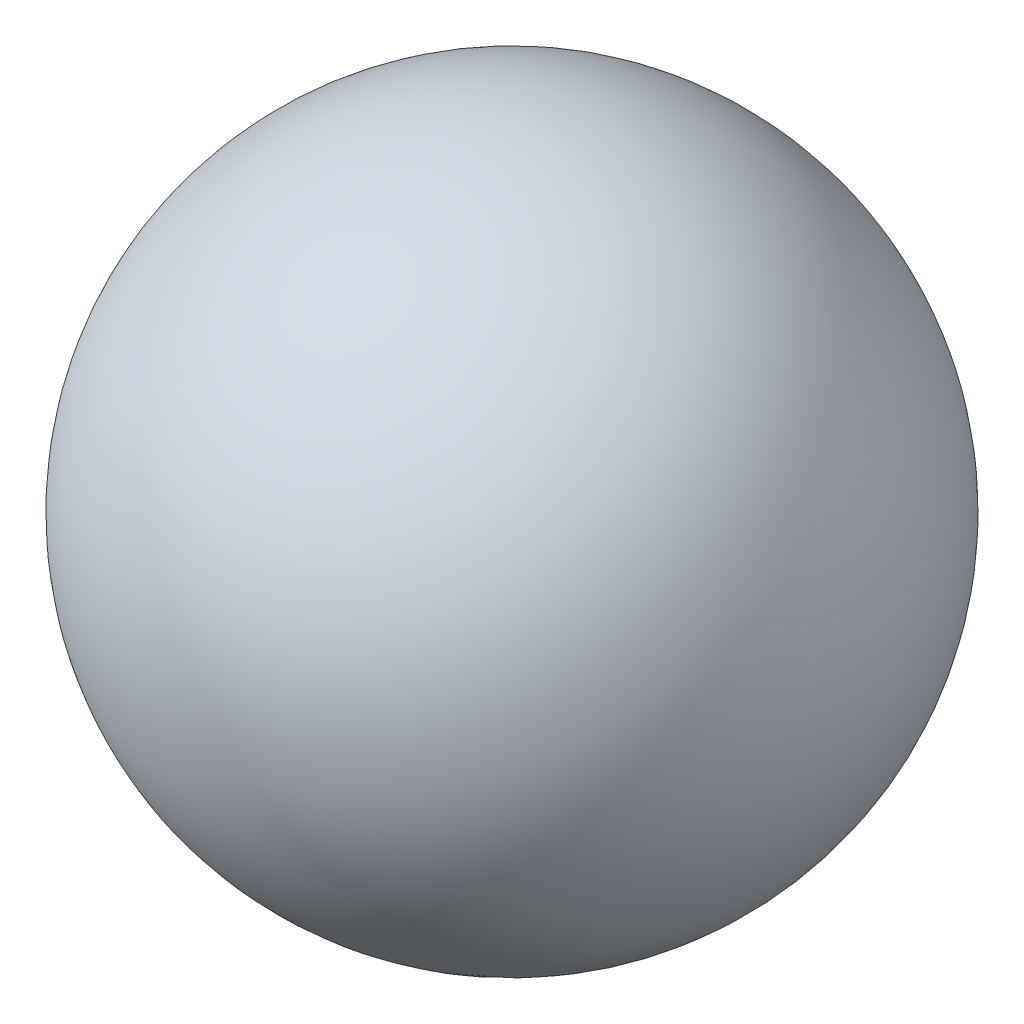
ISO-10303-21;
HEADER;
FILE_DESCRIPTION(('STEP AP214'),'2;1');
FILE_NAME('part.step','',(''),(''),'','','');
FILE_SCHEMA(('AUTOMOTIVE_DESIGN { 1 0 10303 214 1 1 1 1 }'));
ENDSEC;
DATA;
#1=APPLICATION_CONTEXT('core data for automotive mechanical design processes');
#2=APPLICATION_PROTOCOL_DEFINITION('international standard','automotive_design',2000,#1);
#3=PRODUCT_CONTEXT('',#1,'mechanical');
#4=PRODUCT('Part','Part','',(#3));
#5=PRODUCT_RELATED_PRODUCT_CATEGORY('part','',(#4));
#6=PRODUCT_DEFINITION_FORMATION('','',#4);
#7=PRODUCT_DEFINITION_CONTEXT('part definition',#1,'design');
#8=PRODUCT_DEFINITION('design','',#6,#7);
#9=PRODUCT_DEFINITION_SHAPE('','',#8);
#10=(LENGTH_UNIT() NAMED_UNIT(*) SI_UNIT(.MILLI.,.METRE.));
#11=(NAMED_UNIT(*) PLANE_ANGLE_UNIT() SI_UNIT($,.RADIAN.));
#12=(NAMED_UNIT(*) SI_UNIT($,.STERADIAN.) SOLID_ANGLE_UNIT());
#13=UNCERTAINTY_MEASURE_WITH_UNIT(LENGTH_MEASURE(1.E-05),#10,'distance_accuracy_value','');
#14=(GEOMETRIC_REPRESENTATION_CONTEXT(3) GLOBAL_UNCERTAINTY_ASSIGNED_CONTEXT((#13)) GLOBAL_UNIT_ASSIGNED_CONTEXT((#10,
#11,#12)) REPRESENTATION_CONTEXT('',''));
#15=CARTESIAN_POINT('',(0.,0.,0.));
#16=DIRECTION('',(0.,0.,1.));
#17=DIRECTION('',(1.,0.,0.));
#18=AXIS2_PLACEMENT_3D('',#15,#16,#17);
#19=CARTESIAN_POINT('',(0.,0.,0.));
#20=DIRECTION('',(0.,0.,1.));
#21=DIRECTION('',(-1.,0.,0.));
#22=AXIS2_PLACEMENT_3D('',#19,#20,#21);
#23=SPHERICAL_SURFACE('',#22,20.);
#24=CARTESIAN_POINT('',(-6.5,0.,0.));
#25=DIRECTION('',(-1.,0.,0.));
#26=DIRECTION('',(0.,0.,1.));
#27=AXIS2_PLACEMENT_3D('',#24,#25,#26);
#28=CIRCLE('',#27,18.9142803193777);
#29=CARTESIAN_POINT('',(-6.5,-16.8967452487158,-8.5));
#30=VERTEX_POINT('',#29);
#31=CARTESIAN_POINT('',(-6.5,-16.8967452487158,8.5));
#32=VERTEX_POINT('',#31);
#33=EDGE_CURVE('E134',#30,#32,#28,.T.);
#34=ORIENTED_EDGE('',*,*,#33,.T.);
#35=CARTESIAN_POINT('',(-6.5,-16.8967452487158,8.5));
#36=CARTESIAN_POINT('',(-6.49999376318244,-16.8367881342585,8.61919141730628));
#37=CARTESIAN_POINT('',(-6.49467104533204,-16.7772219118733,8.73852686841631));
#38=CARTESIAN_POINT('',(-6.47327854145581,-16.6592450993487,8.97686071788792));
#39=CARTESIAN_POINT('',(-6.45720456710805,-16.6008349687168,9.09585896673711));
#40=CARTESIAN_POINT('',(-6.3925007431121,-16.4274610357574,9.45231560061206));
#41=CARTESIAN_POINT('',(-6.32738664378277,-16.314890403822,9.68817108218945));
#42=CARTESIAN_POINT('',(-6.15262165026794,-16.1001752719661,10.1489887531046));
#43=CARTESIAN_POINT('',(-6.04284925214079,-15.998060175278,10.373919334601));
#44=CARTESIAN_POINT('',(-5.84561038890766,-15.8568845783667,10.6960824044829));
#45=CARTESIAN_POINT('',(-5.77445963035965,-15.8118369791686,10.8009028563226));
#46=CARTESIAN_POINT('',(-5.62151864141891,-15.7263629975264,11.004454776878));
#47=CARTESIAN_POINT('',(-5.53973510966124,-15.6859337354104,11.1031900220199));
#48=CARTESIAN_POINT('',(-5.37423953151036,-15.6139957920711,11.28430049176));
#49=CARTESIAN_POINT('',(-5.29145989423178,-15.5820037606912,11.3673372721214));
#50=CARTESIAN_POINT('',(-5.11800479405772,-15.5228802142727,11.5265317286208));
#51=CARTESIAN_POINT('',(-5.02733403862039,-15.495745830536,11.6026934515803));
#52=CARTESIAN_POINT('',(-4.83870098175006,-15.4468103505463,11.7472438065387));
#53=CARTESIAN_POINT('',(-4.74074148755169,-15.4250072147064,11.8156354057927));
#54=CARTESIAN_POINT('',(-4.53829135479281,-15.3871509666637,11.9437934115337));
#55=CARTESIAN_POINT('',(-4.43380185354477,-15.3710968564296,12.0035613140184));
#56=CARTESIAN_POINT('',(-4.23365775172472,-15.3468202002661,12.106291007457));
#57=CARTESIAN_POINT('',(-4.13869811103613,-15.3378360100475,12.150431731578));
#58=CARTESIAN_POINT('',(-3.94532985325401,-15.3245772396421,12.2312192704823));
#59=CARTESIAN_POINT('',(-3.84692162959918,-15.320302124004,12.2678669368872));
#60=CARTESIAN_POINT('',(-3.64751450761934,-15.3165360276597,12.3333032600585));
#61=CARTESIAN_POINT('',(-3.54651748819676,-15.3170416700219,12.3620974494102));
#62=CARTESIAN_POINT('',(-3.3427374099056,-15.3228177568241,12.4116221190603));
#63=CARTESIAN_POINT('',(-3.23995498732285,-15.3280865366015,12.4323554129305));
#64=CARTESIAN_POINT('',(-3.03088558050845,-15.3434876216961,12.4660602696253));
#65=CARTESIAN_POINT('',(-2.92457449976527,-15.3537361309077,12.4788288243646));
#66=CARTESIAN_POINT('',(-2.71204841485452,-15.3789236562842,12.4958003911938));
#67=CARTESIAN_POINT('',(-2.60583367151853,-15.3938528619271,12.5000211822262));
#68=CARTESIAN_POINT('',(-2.5,-15.4110350074224,12.5));
#69=B_SPLINE_CURVE_WITH_KNOTS('',3,(#35,#36,#37,#38,#39,#40,#41,#42,#43,#44,#45,#46,#47,#48,#49,
#50,#51,#52,#53,#54,#55,#56,#57,#58,#59,#60,#61,#62,#63,#64,#65,#66,#67,#68),.UNSPECIFIED.,.F.,
.F.,(4,2,2,2,2,2,2,2,2,2,2,2,2,2,2,2,4),(0.,0.400059142691313,0.800274225587917,
1.60423831208424,2.41040456820755,2.8132520749623,3.21584700703939,3.57994025204138,
3.94381776627734,4.30755585254038,4.67123076319907,4.98612350570043,5.30098043922891,
5.61561498734561,5.93013961674454,6.25238444943157,6.57395833692662),.UNSPECIFIED.);
#70=CARTESIAN_POINT('',(-2.5,-15.4110350074224,12.5));
#71=VERTEX_POINT('',#70);
#72=EDGE_CURVE('E162',#32,#71,#69,.T.);
#73=ORIENTED_EDGE('',*,*,#72,.T.);
#74=CARTESIAN_POINT('',(0.,0.,12.5));
#75=DIRECTION('',(0.,0.,1.));
#76=DIRECTION('',(1.,0.,0.));
#77=AXIS2_PLACEMENT_3D('',#74,#75,#76);
#78=CIRCLE('',#77,15.612494995996);
#79=CARTESIAN_POINT('',(2.5,-15.4110350074224,12.5));
#80=VERTEX_POINT('',#79);
#81=EDGE_CURVE('E125',#71,#80,#78,.T.);
#82=ORIENTED_EDGE('',*,*,#81,.T.);
#83=CARTESIAN_POINT('',(2.5,-15.4110350074224,12.5));
#84=CARTESIAN_POINT('',(2.59738038519083,-15.3952282696164,12.5000148213943));
#85=CARTESIAN_POINT('',(2.69508024486914,-15.3813255532214,12.4964443244474));
#86=CARTESIAN_POINT('',(2.89044586607563,-15.3574814182854,12.4820993500437));
#87=CARTESIAN_POINT('',(2.98811162156256,-15.3475405121033,12.4713239412978));
#88=CARTESIAN_POINT('',(3.18255066929817,-15.3317903628193,12.4425594165742));
#89=CARTESIAN_POINT('',(3.27932516375751,-15.325974361548,12.4245821759372));
#90=CARTESIAN_POINT('',(3.47142933766073,-15.318532360721,12.3814961401043));
#91=CARTESIAN_POINT('',(3.56675913489966,-15.3169060177094,12.3563879296716));
#92=CARTESIAN_POINT('',(3.75539293433253,-15.3178685885579,12.2991727800464));
#93=CARTESIAN_POINT('',(3.84869448864158,-15.3204623373541,12.2670578498045));
#94=CARTESIAN_POINT('',(4.03251988927804,-15.3298356353688,12.1960918680488));
#95=CARTESIAN_POINT('',(4.12304268359437,-15.3366167498573,12.1572383014875));
#96=CARTESIAN_POINT('',(4.30060029606627,-15.3542614783381,12.07316063338));
#97=CARTESIAN_POINT('',(4.38763726831352,-15.3651225266426,12.0279405466037));
#98=CARTESIAN_POINT('',(4.55773919754725,-15.3907677735966,11.9315137822873));
#99=CARTESIAN_POINT('',(4.64080262813068,-15.4055534658075,11.8803048297852));
#100=CARTESIAN_POINT('',(4.88337806728256,-15.45553866524,11.718267896581));
#101=CARTESIAN_POINT('',(5.03626357260689,-15.4963651054398,11.5990354006361));
#102=CARTESIAN_POINT('',(5.32106637967054,-15.5909729245315,11.342262090132));
#103=CARTESIAN_POINT('',(5.45297406407673,-15.6447602170995,11.204712931043));
#104=CARTESIAN_POINT('',(5.70421893362637,-15.7680434301898,10.9030476449279));
#105=CARTESIAN_POINT('',(5.82158158675651,-15.8384770121789,10.7376716659214));
#106=CARTESIAN_POINT('',(6.0285963358221,-15.9892385784958,10.3945266003605));
#107=CARTESIAN_POINT('',(6.1182285174705,-16.0695736158011,10.216748719296));
#108=CARTESIAN_POINT('',(6.27889155103766,-16.2481674906663,9.83009006167));
#109=CARTESIAN_POINT('',(6.34617113011318,-16.3474101903572,9.62010759001408));
#110=CARTESIAN_POINT('',(6.44516668446247,-16.5519643767159,9.1951210889375));
#111=CARTESIAN_POINT('',(6.47692305807516,-16.6572688260762,8.9801230481741));
#112=CARTESIAN_POINT('',(6.49708269575086,-16.8081535716689,8.67662013097272));
#113=CARTESIAN_POINT('',(6.50000578257493,-16.8523596129254,8.5882364623455));
#114=CARTESIAN_POINT('',(6.50000000000009,-16.8967452487158,8.49999999999999));
#115=B_SPLINE_CURVE_WITH_KNOTS('',3,(#83,#84,#85,#86,#87,#88,#89,#90,#91,#92,#93,#94,#95,#96,
#97,#98,#99,#100,#101,#102,#103,#104,#105,#106,#107,#108,#109,#110,#111,#112,#113,#114),
.UNSPECIFIED.,.F.,.F.,(4,2,2,2,2,2,2,2,2,2,2,2,2,2,2,4),(0.,0.295896456010633,0.591831166267823,
0.887279895354373,1.18270440365701,1.47846761661165,1.77434145515047,2.07002954249381,
2.36583031854621,2.9574702952876,3.54938073373924,4.19080463658617,4.83268810636278,
5.55520721793995,6.27690381531875,6.57330293254065),.UNSPECIFIED.);
#116=CARTESIAN_POINT('',(6.5,-16.8967452487158,8.5));
#117=VERTEX_POINT('',#116);
#118=EDGE_CURVE('E169',#80,#117,#115,.T.);
#119=ORIENTED_EDGE('',*,*,#118,.T.);
#120=CARTESIAN_POINT('',(6.5,0.,0.));
#121=DIRECTION('',(1.,0.,0.));
#122=DIRECTION('',(0.,0.,-1.));
#123=AXIS2_PLACEMENT_3D('',#120,#121,#122);
#124=CIRCLE('',#123,18.9142803193777);
#125=CARTESIAN_POINT('',(6.5,-16.8967452487158,-8.5));
#126=VERTEX_POINT('',#125);
#127=EDGE_CURVE('E143',#117,#126,#124,.T.);
#128=ORIENTED_EDGE('',*,*,#127,.T.);
#129=CARTESIAN_POINT('',(6.5,-16.8967452487158,-8.5));
#130=CARTESIAN_POINT('',(6.49999376318244,-16.8367881342585,-8.61919141730628));
#131=CARTESIAN_POINT('',(6.49467104533204,-16.7772219118733,-8.73852686841631));
#132=CARTESIAN_POINT('',(6.47327854145581,-16.6592450993487,-8.97686071788792));
#133=CARTESIAN_POINT('',(6.45720456710805,-16.6008349687168,-9.09585896673711));
#134=CARTESIAN_POINT('',(6.3925007431121,-16.4274610357574,-9.45231560061206));
#135=CARTESIAN_POINT('',(6.32738664378277,-16.314890403822,-9.68817108218945));
#136=CARTESIAN_POINT('',(6.15262165026794,-16.1001752719661,-10.1489887531046));
#137=CARTESIAN_POINT('',(6.04284925214079,-15.998060175278,-10.373919334601));
#138=CARTESIAN_POINT('',(5.84561038890766,-15.8568845783667,-10.6960824044829));
#139=CARTESIAN_POINT('',(5.77445963035965,-15.8118369791686,-10.8009028563226));
#140=CARTESIAN_POINT('',(5.62151864141891,-15.7263629975264,-11.004454776878));
#141=CARTESIAN_POINT('',(5.53973510966124,-15.6859337354104,-11.1031900220199));
#142=CARTESIAN_POINT('',(5.37423953151036,-15.6139957920711,-11.28430049176));
#143=CARTESIAN_POINT('',(5.29145989423178,-15.5820037606912,-11.3673372721214));
#144=CARTESIAN_POINT('',(5.11800479405772,-15.5228802142727,-11.5265317286208));
#145=CARTESIAN_POINT('',(5.02733403862039,-15.495745830536,-11.6026934515803));
#146=CARTESIAN_POINT('',(4.83870098175006,-15.4468103505463,-11.7472438065387));
#147=CARTESIAN_POINT('',(4.74074148755169,-15.4250072147064,-11.8156354057927));
#148=CARTESIAN_POINT('',(4.53829135479281,-15.3871509666637,-11.9437934115337));
#149=CARTESIAN_POINT('',(4.43380185354477,-15.3710968564296,-12.0035613140184));
#150=CARTESIAN_POINT('',(4.23365775172472,-15.3468202002661,-12.106291007457));
#151=CARTESIAN_POINT('',(4.13869811103613,-15.3378360100475,-12.150431731578));
#152=CARTESIAN_POINT('',(3.94532985325401,-15.3245772396421,-12.2312192704823));
#153=CARTESIAN_POINT('',(3.84692162959918,-15.320302124004,-12.2678669368872));
#154=CARTESIAN_POINT('',(3.64751450761934,-15.3165360276597,-12.3333032600585));
#155=CARTESIAN_POINT('',(3.54651748819676,-15.3170416700219,-12.3620974494102));
#156=CARTESIAN_POINT('',(3.3427374099056,-15.3228177568241,-12.4116221190603));
#157=CARTESIAN_POINT('',(3.23995498732285,-15.3280865366015,-12.4323554129305));
#158=CARTESIAN_POINT('',(3.03088558050845,-15.3434876216961,-12.4660602696253));
#159=CARTESIAN_POINT('',(2.92457449976527,-15.3537361309077,-12.4788288243646));
#160=CARTESIAN_POINT('',(2.71204841485452,-15.3789236562842,-12.4958003911938));
#161=CARTESIAN_POINT('',(2.60583367151853,-15.3938528619271,-12.5000211822262));
#162=CARTESIAN_POINT('',(2.5,-15.4110350074224,-12.5));
#163=B_SPLINE_CURVE_WITH_KNOTS('',3,(#129,#130,#131,#132,#133,#134,#135,#136,#137,#138,#139,
#140,#141,#142,#143,#144,#145,#146,#147,#148,#149,#150,#151,#152,#153,#154,#155,#156,#157,#158,
#159,#160,#161,#162),.UNSPECIFIED.,.F.,.F.,(4,2,2,2,2,2,2,2,2,2,2,2,2,2,2,2,4),(0.,
0.400059142691313,0.800274225587917,1.60423831208424,2.41040456820755,2.8132520749623,
3.21584700703939,3.57994025204138,3.94381776627734,4.30755585254038,4.67123076319907,
4.98612350570043,5.30098043922891,5.61561498734561,5.93013961674454,6.25238444943157,
6.57395833692662),.UNSPECIFIED.);
#164=CARTESIAN_POINT('',(2.5,-15.4110350074224,-12.5));
#165=VERTEX_POINT('',#164);
#166=EDGE_CURVE('E48',#126,#165,#163,.T.);
#167=ORIENTED_EDGE('',*,*,#166,.T.);
#168=CARTESIAN_POINT('',(0.,0.,-12.5));
#169=DIRECTION('',(0.,0.,-1.));
#170=DIRECTION('',(-1.,0.,0.));
#171=AXIS2_PLACEMENT_3D('',#168,#169,#170);
#172=CIRCLE('',#171,15.612494995996);
#173=CARTESIAN_POINT('',(-2.5,-15.4110350074224,-12.5));
#174=VERTEX_POINT('',#173);
#175=EDGE_CURVE('E131',#165,#174,#172,.T.);
#176=ORIENTED_EDGE('',*,*,#175,.T.);
#177=CARTESIAN_POINT('',(-2.5,-15.4110350074224,-12.5));
#178=CARTESIAN_POINT('',(-2.59738038519083,-15.3952282696164,-12.5000148213943));
#179=CARTESIAN_POINT('',(-2.69508024486914,-15.3813255532214,-12.4964443244474));
#180=CARTESIAN_POINT('',(-2.89044586607563,-15.3574814182854,-12.4820993500437));
#181=CARTESIAN_POINT('',(-2.98811162156256,-15.3475405121033,-12.4713239412978));
#182=CARTESIAN_POINT('',(-3.18255066929817,-15.3317903628193,-12.4425594165742));
#183=CARTESIAN_POINT('',(-3.27932516375751,-15.325974361548,-12.4245821759372));
#184=CARTESIAN_POINT('',(-3.47142933766073,-15.318532360721,-12.3814961401043));
#185=CARTESIAN_POINT('',(-3.56675913489966,-15.3169060177094,-12.3563879296716));
#186=CARTESIAN_POINT('',(-3.75539293433253,-15.3178685885579,-12.2991727800464));
#187=CARTESIAN_POINT('',(-3.84869448864158,-15.3204623373541,-12.2670578498045));
#188=CARTESIAN_POINT('',(-4.03251988927804,-15.3298356353688,-12.1960918680488));
#189=CARTESIAN_POINT('',(-4.12304268359437,-15.3366167498573,-12.1572383014875));
#190=CARTESIAN_POINT('',(-4.30060029606627,-15.3542614783381,-12.07316063338));
#191=CARTESIAN_POINT('',(-4.38763726831352,-15.3651225266426,-12.0279405466037));
#192=CARTESIAN_POINT('',(-4.55773919754725,-15.3907677735966,-11.9315137822873));
#193=CARTESIAN_POINT('',(-4.64080262813068,-15.4055534658075,-11.8803048297852));
#194=CARTESIAN_POINT('',(-4.88337806728256,-15.45553866524,-11.718267896581));
#195=CARTESIAN_POINT('',(-5.03626357260689,-15.4963651054398,-11.5990354006361));
#196=CARTESIAN_POINT('',(-5.32106637967054,-15.5909729245315,-11.342262090132));
#197=CARTESIAN_POINT('',(-5.45297406407673,-15.6447602170995,-11.204712931043));
#198=CARTESIAN_POINT('',(-5.70421893362637,-15.7680434301898,-10.9030476449279));
#199=CARTESIAN_POINT('',(-5.82158158675651,-15.8384770121789,-10.7376716659214));
#200=CARTESIAN_POINT('',(-6.0285963358221,-15.9892385784958,-10.3945266003605));
#201=CARTESIAN_POINT('',(-6.1182285174705,-16.0695736158011,-10.216748719296));
#202=CARTESIAN_POINT('',(-6.27889155103766,-16.2481674906663,-9.83009006167));
#203=CARTESIAN_POINT('',(-6.34617113011318,-16.3474101903572,-9.62010759001408));
#204=CARTESIAN_POINT('',(-6.44516668446247,-16.5519643767159,-9.1951210889375));
#205=CARTESIAN_POINT('',(-6.47692305807516,-16.6572688260762,-8.9801230481741));
#206=CARTESIAN_POINT('',(-6.49708269575086,-16.8081535716689,-8.67662013097272));
#207=CARTESIAN_POINT('',(-6.50000578257493,-16.8523596129254,-8.5882364623455));
#208=CARTESIAN_POINT('',(-6.50000000000009,-16.8967452487158,-8.49999999999999));
#209=B_SPLINE_CURVE_WITH_KNOTS('',3,(#177,#178,#179,#180,#181,#182,#183,#184,#185,#186,#187,
#188,#189,#190,#191,#192,#193,#194,#195,#196,#197,#198,#199,#200,#201,#202,#203,#204,#205,#206,
#207,#208),.UNSPECIFIED.,.F.,.F.,(4,2,2,2,2,2,2,2,2,2,2,2,2,2,2,4),(0.,0.295896456010633,
0.591831166267823,0.887279895354373,1.18270440365701,1.47846761661165,1.77434145515047,
2.07002954249381,2.36583031854621,2.9574702952876,3.54938073373924,4.19080463658617,
4.83268810636278,5.55520721793995,6.27690381531875,6.57330293254065),.UNSPECIFIED.);
#210=EDGE_CURVE('E11',#174,#30,#209,.T.);
#211=ORIENTED_EDGE('',*,*,#210,.T.);
#212=EDGE_LOOP('',(#34,#73,#82,#119,#128,#167,#176,#211));
#213=FACE_BOUND('',#212,.T.);
#214=ADVANCED_FACE('F34',(#213),#23,.T.);
#215=CARTESIAN_POINT('',(6.5,-27.,12.5));
#216=DIRECTION('',(1.,0.,0.));
#217=DIRECTION('',(0.,0.,-1.));
#218=AXIS2_PLACEMENT_3D('',#215,#216,#217);
#219=PLANE('',#218);
#220=ORIENTED_EDGE('',*,*,#127,.F.);
#221=DIRECTION('',(0.,1.,0.));
#222=VECTOR('',#221,1.);
#223=CARTESIAN_POINT('',(6.5,0.,8.5));
#224=LINE('',#223,#222);
#225=CARTESIAN_POINT('',(6.5,0.,8.5));
#226=VERTEX_POINT('',#225);
#227=EDGE_CURVE('E155',#117,#226,#224,.T.);
#228=ORIENTED_EDGE('',*,*,#227,.T.);
#229=DIRECTION('',(0.,0.,-1.));
#230=VECTOR('',#229,1.);
#231=CARTESIAN_POINT('',(6.5,0.,12.5));
#232=LINE('',#231,#230);
#233=CARTESIAN_POINT('',(6.5,0.,-8.5));
#234=VERTEX_POINT('',#233);
#235=EDGE_CURVE('E198',#226,#234,#232,.T.);
#236=ORIENTED_EDGE('',*,*,#235,.T.);
#237=DIRECTION('',(0.,1.,0.));
#238=VECTOR('',#237,1.);
#239=CARTESIAN_POINT('',(6.5,-14.1950695665784,-8.5));
#240=LINE('',#239,#238);
#241=EDGE_CURVE('E153',#234,#126,#240,.F.);
#242=ORIENTED_EDGE('',*,*,#241,.T.);
#243=EDGE_LOOP('',(#220,#228,#236,#242));
#244=FACE_BOUND('',#243,.T.);
#245=ADVANCED_FACE('F195',(#244),#219,.F.);
#246=CARTESIAN_POINT('',(-6.5,-27.,12.5));
#247=DIRECTION('',(0.,0.,1.));
#248=DIRECTION('',(1.,0.,0.));
#249=AXIS2_PLACEMENT_3D('',#246,#247,#248);
#250=PLANE('',#249);
#251=ORIENTED_EDGE('',*,*,#81,.F.);
#252=DIRECTION('',(0.,1.,0.));
#253=VECTOR('',#252,1.);
#254=CARTESIAN_POINT('',(-2.5,0.,12.5));
#255=LINE('',#254,#253);
#256=CARTESIAN_POINT('',(-2.5,0.,12.5));
#257=VERTEX_POINT('',#256);
#258=EDGE_CURVE('E109',#71,#257,#255,.T.);
#259=ORIENTED_EDGE('',*,*,#258,.T.);
#260=DIRECTION('',(1.,0.,0.));
#261=VECTOR('',#260,1.);
#262=CARTESIAN_POINT('',(-6.5,0.,12.5));
#263=LINE('',#262,#261);
#264=CARTESIAN_POINT('',(2.5,0.,12.5));
#265=VERTEX_POINT('',#264);
#266=EDGE_CURVE('E122',#257,#265,#263,.T.);
#267=ORIENTED_EDGE('',*,*,#266,.T.);
#268=DIRECTION('',(0.,1.,0.));
#269=VECTOR('',#268,1.);
#270=CARTESIAN_POINT('',(2.5,-14.1950695665784,12.5));
#271=LINE('',#270,#269);
#272=EDGE_CURVE('E127',#265,#80,#271,.F.);
#273=ORIENTED_EDGE('',*,*,#272,.T.);
#274=EDGE_LOOP('',(#251,#259,#267,#273));
#275=FACE_BOUND('',#274,.T.);
#276=ADVANCED_FACE('F121',(#275),#250,.F.);
#277=CARTESIAN_POINT('',(-6.5,-27.,12.5));
#278=DIRECTION('',(-1.,0.,0.));
#279=DIRECTION('',(0.,0.,1.));
#280=AXIS2_PLACEMENT_3D('',#277,#278,#279);
#281=PLANE('',#280);
#282=DIRECTION('',(0.,0.,1.));
#283=VECTOR('',#282,1.);
#284=CARTESIAN_POINT('',(-6.5,0.,12.5));
#285=LINE('',#284,#283);
#286=CARTESIAN_POINT('',(-6.5,0.,-8.5));
#287=VERTEX_POINT('',#286);
#288=CARTESIAN_POINT('',(-6.5,0.,8.5));
#289=VERTEX_POINT('',#288);
#290=EDGE_CURVE('E132',#287,#289,#285,.T.);
#291=ORIENTED_EDGE('',*,*,#290,.T.);
#292=DIRECTION('',(0.,1.,0.));
#293=VECTOR('',#292,1.);
#294=CARTESIAN_POINT('',(-6.5,-14.1950695665784,8.5));
#295=LINE('',#294,#293);
#296=EDGE_CURVE('E110',#289,#32,#295,.F.);
#297=ORIENTED_EDGE('',*,*,#296,.T.);
#298=ORIENTED_EDGE('',*,*,#33,.F.);
#299=DIRECTION('',(0.,1.,0.));
#300=VECTOR('',#299,1.);
#301=CARTESIAN_POINT('',(-6.5,0.,-8.5));
#302=LINE('',#301,#300);
#303=EDGE_CURVE('E115',#30,#287,#302,.T.);
#304=ORIENTED_EDGE('',*,*,#303,.T.);
#305=EDGE_LOOP('',(#291,#297,#298,#304));
#306=FACE_BOUND('',#305,.T.);
#307=ADVANCED_FACE('F208',(#306),#281,.F.);
#308=CARTESIAN_POINT('',(-6.5,-27.,-12.5));
#309=DIRECTION('',(0.,0.,-1.));
#310=DIRECTION('',(-1.,0.,0.));
#311=AXIS2_PLACEMENT_3D('',#308,#309,#310);
#312=PLANE('',#311);
#313=ORIENTED_EDGE('',*,*,#175,.F.);
#314=DIRECTION('',(0.,1.,0.));
#315=VECTOR('',#314,1.);
#316=CARTESIAN_POINT('',(2.5,0.,-12.5));
#317=LINE('',#316,#315);
#318=CARTESIAN_POINT('',(2.5,0.,-12.5));
#319=VERTEX_POINT('',#318);
#320=EDGE_CURVE('E159',#165,#319,#317,.T.);
#321=ORIENTED_EDGE('',*,*,#320,.T.);
#322=DIRECTION('',(-1.,0.,0.));
#323=VECTOR('',#322,1.);
#324=CARTESIAN_POINT('',(-6.5,0.,-12.5));
#325=LINE('',#324,#323);
#326=CARTESIAN_POINT('',(-2.5,0.,-12.5));
#327=VERTEX_POINT('',#326);
#328=EDGE_CURVE('E136',#319,#327,#325,.T.);
#329=ORIENTED_EDGE('',*,*,#328,.T.);
#330=DIRECTION('',(0.,1.,0.));
#331=VECTOR('',#330,1.);
#332=CARTESIAN_POINT('',(-2.5,-14.1950695665784,-12.5));
#333=LINE('',#332,#331);
#334=EDGE_CURVE('E55',#327,#174,#333,.F.);
#335=ORIENTED_EDGE('',*,*,#334,.T.);
#336=EDGE_LOOP('',(#313,#321,#329,#335));
#337=FACE_BOUND('',#336,.T.);
#338=ADVANCED_FACE('F201',(#337),#312,.F.);
#339=CARTESIAN_POINT('',(0.,0.,0.));
#340=DIRECTION('',(0.,-1.,0.));
#341=DIRECTION('',(0.,0.,-1.));
#342=AXIS2_PLACEMENT_3D('',#339,#340,#341);
#343=PLANE('',#342);
#344=ORIENTED_EDGE('',*,*,#266,.F.);
#345=CARTESIAN_POINT('',(-2.5,0.,8.5));
#346=DIRECTION('',(0.,-1.,0.));
#347=DIRECTION('',(0.,0.,-1.));
#348=AXIS2_PLACEMENT_3D('',#345,#346,#347);
#349=CIRCLE('',#348,4.);
#350=EDGE_CURVE('E105',#257,#289,#349,.T.);
#351=ORIENTED_EDGE('',*,*,#350,.T.);
#352=ORIENTED_EDGE('',*,*,#290,.F.);
#353=CARTESIAN_POINT('',(-2.5,0.,-8.5));
#354=DIRECTION('',(0.,-1.,0.));
#355=DIRECTION('',(0.,0.,-1.));
#356=AXIS2_PLACEMENT_3D('',#353,#354,#355);
#357=CIRCLE('',#356,4.);
#358=EDGE_CURVE('E126',#287,#327,#357,.T.);
#359=ORIENTED_EDGE('',*,*,#358,.T.);
#360=ORIENTED_EDGE('',*,*,#328,.F.);
#361=CARTESIAN_POINT('',(2.5,0.,-8.5));
#362=DIRECTION('',(0.,-1.,0.));
#363=DIRECTION('',(0.,0.,-1.));
#364=AXIS2_PLACEMENT_3D('',#361,#362,#363);
#365=CIRCLE('',#364,4.);
#366=EDGE_CURVE('E147',#319,#234,#365,.T.);
#367=ORIENTED_EDGE('',*,*,#366,.T.);
#368=ORIENTED_EDGE('',*,*,#235,.F.);
#369=CARTESIAN_POINT('',(2.5,0.,8.5));
#370=DIRECTION('',(0.,-1.,0.));
#371=DIRECTION('',(0.,0.,-1.));
#372=AXIS2_PLACEMENT_3D('',#369,#370,#371);
#373=CIRCLE('',#372,4.);
#374=EDGE_CURVE('E116',#226,#265,#373,.T.);
#375=ORIENTED_EDGE('',*,*,#374,.T.);
#376=EDGE_LOOP('',(#344,#351,#352,#359,#360,#367,#368,#375));
#377=FACE_BOUND('',#376,.T.);
#378=ADVANCED_FACE('F129',(#377),#343,.T.);
#379=CARTESIAN_POINT('',(-2.5,-27.,8.5));
#380=DIRECTION('',(0.,-1.,0.));
#381=DIRECTION('',(0.,0.,-1.));
#382=AXIS2_PLACEMENT_3D('',#379,#380,#381);
#383=CYLINDRICAL_SURFACE('',#382,4.);
#384=ORIENTED_EDGE('',*,*,#72,.F.);
#385=ORIENTED_EDGE('',*,*,#296,.F.);
#386=ORIENTED_EDGE('',*,*,#350,.F.);
#387=ORIENTED_EDGE('',*,*,#258,.F.);
#388=EDGE_LOOP('',(#384,#385,#386,#387));
#389=FACE_BOUND('',#388,.T.);
#390=ADVANCED_FACE('F108',(#389),#383,.F.);
#391=CARTESIAN_POINT('',(2.5,-27.,8.5));
#392=DIRECTION('',(0.,-1.,0.));
#393=DIRECTION('',(0.,0.,-1.));
#394=AXIS2_PLACEMENT_3D('',#391,#392,#393);
#395=CYLINDRICAL_SURFACE('',#394,4.);
#396=ORIENTED_EDGE('',*,*,#118,.F.);
#397=ORIENTED_EDGE('',*,*,#272,.F.);
#398=ORIENTED_EDGE('',*,*,#374,.F.);
#399=ORIENTED_EDGE('',*,*,#227,.F.);
#400=EDGE_LOOP('',(#396,#397,#398,#399));
#401=FACE_BOUND('',#400,.T.);
#402=ADVANCED_FACE('F179',(#401),#395,.F.);
#403=CARTESIAN_POINT('',(2.5,-27.,-8.5));
#404=DIRECTION('',(0.,-1.,0.));
#405=DIRECTION('',(0.,0.,-1.));
#406=AXIS2_PLACEMENT_3D('',#403,#404,#405);
#407=CYLINDRICAL_SURFACE('',#406,4.);
#408=ORIENTED_EDGE('',*,*,#166,.F.);
#409=ORIENTED_EDGE('',*,*,#241,.F.);
#410=ORIENTED_EDGE('',*,*,#366,.F.);
#411=ORIENTED_EDGE('',*,*,#320,.F.);
#412=EDGE_LOOP('',(#408,#409,#410,#411));
#413=FACE_BOUND('',#412,.T.);
#414=ADVANCED_FACE('F182',(#413),#407,.F.);
#415=CARTESIAN_POINT('',(-2.5,-27.,-8.5));
#416=DIRECTION('',(0.,-1.,0.));
#417=DIRECTION('',(0.,0.,-1.));
#418=AXIS2_PLACEMENT_3D('',#415,#416,#417);
#419=CYLINDRICAL_SURFACE('',#418,4.);
#420=ORIENTED_EDGE('',*,*,#210,.F.);
#421=ORIENTED_EDGE('',*,*,#334,.F.);
#422=ORIENTED_EDGE('',*,*,#358,.F.);
#423=ORIENTED_EDGE('',*,*,#303,.F.);
#424=EDGE_LOOP('',(#420,#421,#422,#423));
#425=FACE_BOUND('',#424,.T.);
#426=ADVANCED_FACE('F36',(#425),#419,.F.);
#427=CLOSED_SHELL('',(#214,#245,#276,#307,#338,#378,#390,#402,#414,#426));
#428=MANIFOLD_SOLID_BREP('B2',#427);
#429=ADVANCED_BREP_SHAPE_REPRESENTATION('',(#18,#428),#14);
#430=SHAPE_DEFINITION_REPRESENTATION(#9,#429);
ENDSEC;
END-ISO-10303-21;
